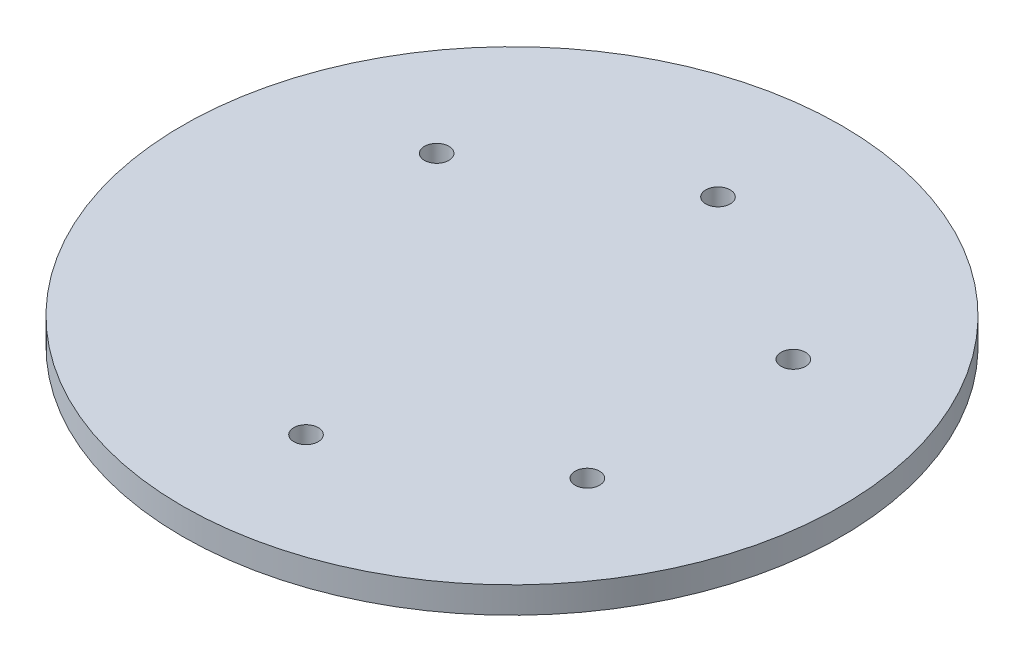
ISO-10303-21;
HEADER;
FILE_DESCRIPTION(('STEP AP214'),'2;1');
FILE_NAME('part.step','',(''),(''),'','','');
FILE_SCHEMA(('AUTOMOTIVE_DESIGN { 1 0 10303 214 1 1 1 1 }'));
ENDSEC;
DATA;
#1=APPLICATION_CONTEXT('core data for automotive mechanical design processes');
#2=APPLICATION_PROTOCOL_DEFINITION('international standard','automotive_design',2000,#1);
#3=PRODUCT_CONTEXT('',#1,'mechanical');
#4=PRODUCT('Part','Part','',(#3));
#5=PRODUCT_RELATED_PRODUCT_CATEGORY('part','',(#4));
#6=PRODUCT_DEFINITION_FORMATION('','',#4);
#7=PRODUCT_DEFINITION_CONTEXT('part definition',#1,'design');
#8=PRODUCT_DEFINITION('design','',#6,#7);
#9=PRODUCT_DEFINITION_SHAPE('','',#8);
#10=(LENGTH_UNIT() NAMED_UNIT(*) SI_UNIT(.MILLI.,.METRE.));
#11=(NAMED_UNIT(*) PLANE_ANGLE_UNIT() SI_UNIT($,.RADIAN.));
#12=(NAMED_UNIT(*) SI_UNIT($,.STERADIAN.) SOLID_ANGLE_UNIT());
#13=UNCERTAINTY_MEASURE_WITH_UNIT(LENGTH_MEASURE(1.E-05),#10,'distance_accuracy_value','');
#14=(GEOMETRIC_REPRESENTATION_CONTEXT(3) GLOBAL_UNCERTAINTY_ASSIGNED_CONTEXT((#13)) GLOBAL_UNIT_ASSIGNED_CONTEXT((#10,
#11,#12)) REPRESENTATION_CONTEXT('',''));
#15=CARTESIAN_POINT('',(0.,0.,0.));
#16=DIRECTION('',(0.,0.,1.));
#17=DIRECTION('',(1.,0.,0.));
#18=AXIS2_PLACEMENT_3D('',#15,#16,#17);
#19=CARTESIAN_POINT('',(0.,-1.6,0.));
#20=DIRECTION('',(0.,1.,0.));
#21=DIRECTION('',(0.,0.,1.));
#22=AXIS2_PLACEMENT_3D('',#19,#20,#21);
#23=CYLINDRICAL_SURFACE('',#22,20.);
#24=CARTESIAN_POINT('',(0.,-1.6,0.));
#25=DIRECTION('',(0.,1.,0.));
#26=DIRECTION('',(0.,0.,1.));
#27=AXIS2_PLACEMENT_3D('',#24,#25,#26);
#28=CIRCLE('',#27,20.);
#29=CARTESIAN_POINT('',(0.,-1.6,20.));
#30=VERTEX_POINT('',#29);
#31=EDGE_CURVE('E10',#30,#30,#28,.T.);
#32=ORIENTED_EDGE('',*,*,#31,.T.);
#33=EDGE_LOOP('',(#32));
#34=FACE_BOUND('',#33,.T.);
#35=CARTESIAN_POINT('',(0.,0.,0.));
#36=DIRECTION('',(0.,1.,0.));
#37=DIRECTION('',(0.,0.,1.));
#38=AXIS2_PLACEMENT_3D('',#35,#36,#37);
#39=CIRCLE('',#38,20.);
#40=CARTESIAN_POINT('',(0.,0.,20.));
#41=VERTEX_POINT('',#40);
#42=EDGE_CURVE('E40',#41,#41,#39,.T.);
#43=ORIENTED_EDGE('',*,*,#42,.F.);
#44=EDGE_LOOP('',(#43));
#45=FACE_BOUND('',#44,.T.);
#46=ADVANCED_FACE('F37',(#34,#45),#23,.T.);
#47=CARTESIAN_POINT('',(0.,-1.6,0.));
#48=DIRECTION('',(0.,1.,0.));
#49=DIRECTION('',(0.,0.,1.));
#50=AXIS2_PLACEMENT_3D('',#47,#48,#49);
#51=PLANE('',#50);
#52=CARTESIAN_POINT('',(-0.00171005024455017,-1.6,12.4988140862944));
#53=DIRECTION('',(0.,-1.,0.));
#54=DIRECTION('',(0.,0.,-1.));
#55=AXIS2_PLACEMENT_3D('',#52,#53,#54);
#56=CIRCLE('',#55,0.743);
#57=CARTESIAN_POINT('',(-0.00171005024455017,-1.6,11.7558140862944));
#58=VERTEX_POINT('',#57);
#59=EDGE_CURVE('E73',#58,#58,#56,.T.);
#60=ORIENTED_EDGE('',*,*,#59,.F.);
#61=EDGE_LOOP('',(#60));
#62=FACE_BOUND('',#61,.T.);
#63=CARTESIAN_POINT('',(10.8234354907875,-1.6,6.25088799010072));
#64=DIRECTION('',(0.,-1.,0.));
#65=DIRECTION('',(0.,0.,-1.));
#66=AXIS2_PLACEMENT_3D('',#63,#64,#65);
#67=CIRCLE('',#66,0.743);
#68=CARTESIAN_POINT('',(10.8234354907875,-1.6,5.50788799010073));
#69=VERTEX_POINT('',#68);
#70=EDGE_CURVE('E70',#69,#69,#67,.T.);
#71=ORIENTED_EDGE('',*,*,#70,.F.);
#72=EDGE_LOOP('',(#71));
#73=FACE_BOUND('',#72,.T.);
#74=CARTESIAN_POINT('',(10.825145541032,-1.6,-6.24792609619374));
#75=DIRECTION('',(0.,-1.,0.));
#76=DIRECTION('',(0.,0.,-1.));
#77=AXIS2_PLACEMENT_3D('',#74,#75,#76);
#78=CIRCLE('',#77,0.743000000000001);
#79=CARTESIAN_POINT('',(10.825145541032,-1.6,-6.99092609619374));
#80=VERTEX_POINT('',#79);
#81=EDGE_CURVE('E64',#80,#80,#78,.T.);
#82=ORIENTED_EDGE('',*,*,#81,.F.);
#83=EDGE_LOOP('',(#82));
#84=FACE_BOUND('',#83,.T.);
#85=CARTESIAN_POINT('',(0.0017100502444629,-1.6,-12.4988140862944));
#86=DIRECTION('',(0.,-1.,0.));
#87=DIRECTION('',(0.,0.,-1.));
#88=AXIS2_PLACEMENT_3D('',#85,#86,#87);
#89=CIRCLE('',#88,0.743);
#90=CARTESIAN_POINT('',(0.0017100502444629,-1.6,-13.2418140862944));
#91=VERTEX_POINT('',#90);
#92=EDGE_CURVE('E58',#91,#91,#89,.T.);
#93=ORIENTED_EDGE('',*,*,#92,.F.);
#94=EDGE_LOOP('',(#93));
#95=FACE_BOUND('',#94,.T.);
#96=CARTESIAN_POINT('',(-10.8234354907876,-1.6,-6.25088799010065));
#97=DIRECTION('',(0.,-1.,0.));
#98=DIRECTION('',(0.,0.,-1.));
#99=AXIS2_PLACEMENT_3D('',#96,#97,#98);
#100=CIRCLE('',#99,0.743);
#101=CARTESIAN_POINT('',(-10.8234354907876,-1.6,-6.99388799010065));
#102=VERTEX_POINT('',#101);
#103=EDGE_CURVE('E52',#102,#102,#100,.T.);
#104=ORIENTED_EDGE('',*,*,#103,.F.);
#105=EDGE_LOOP('',(#104));
#106=FACE_BOUND('',#105,.T.);
#107=ORIENTED_EDGE('',*,*,#31,.F.);
#108=EDGE_LOOP('',(#107));
#109=FACE_BOUND('',#108,.T.);
#110=ADVANCED_FACE('F89',(#62,#73,#84,#95,#106,#109),#51,.F.);
#111=CARTESIAN_POINT('',(0.,0.,0.));
#112=DIRECTION('',(0.,1.,0.));
#113=DIRECTION('',(0.,0.,1.));
#114=AXIS2_PLACEMENT_3D('',#111,#112,#113);
#115=PLANE('',#114);
#116=CARTESIAN_POINT('',(-0.00171005024455017,0.,12.4988140862944));
#117=DIRECTION('',(0.,-1.,0.));
#118=DIRECTION('',(0.,0.,-1.));
#119=AXIS2_PLACEMENT_3D('',#116,#117,#118);
#120=CIRCLE('',#119,0.743);
#121=CARTESIAN_POINT('',(-0.00171005024455017,0.,11.7558140862944));
#122=VERTEX_POINT('',#121);
#123=EDGE_CURVE('E47',#122,#122,#120,.T.);
#124=ORIENTED_EDGE('',*,*,#123,.T.);
#125=EDGE_LOOP('',(#124));
#126=FACE_BOUND('',#125,.T.);
#127=CARTESIAN_POINT('',(10.8234354907875,0.,6.25088799010072));
#128=DIRECTION('',(0.,-1.,0.));
#129=DIRECTION('',(0.,0.,-1.));
#130=AXIS2_PLACEMENT_3D('',#127,#128,#129);
#131=CIRCLE('',#130,0.743);
#132=CARTESIAN_POINT('',(10.8234354907875,0.,5.50788799010073));
#133=VERTEX_POINT('',#132);
#134=EDGE_CURVE('E67',#133,#133,#131,.T.);
#135=ORIENTED_EDGE('',*,*,#134,.T.);
#136=EDGE_LOOP('',(#135));
#137=FACE_BOUND('',#136,.T.);
#138=CARTESIAN_POINT('',(10.825145541032,0.,-6.24792609619374));
#139=DIRECTION('',(0.,-1.,0.));
#140=DIRECTION('',(0.,0.,-1.));
#141=AXIS2_PLACEMENT_3D('',#138,#139,#140);
#142=CIRCLE('',#141,0.743000000000001);
#143=CARTESIAN_POINT('',(10.825145541032,0.,-6.99092609619374));
#144=VERTEX_POINT('',#143);
#145=EDGE_CURVE('E61',#144,#144,#142,.T.);
#146=ORIENTED_EDGE('',*,*,#145,.T.);
#147=EDGE_LOOP('',(#146));
#148=FACE_BOUND('',#147,.T.);
#149=CARTESIAN_POINT('',(0.0017100502444629,0.,-12.4988140862944));
#150=DIRECTION('',(0.,-1.,0.));
#151=DIRECTION('',(0.,0.,-1.));
#152=AXIS2_PLACEMENT_3D('',#149,#150,#151);
#153=CIRCLE('',#152,0.743);
#154=CARTESIAN_POINT('',(0.0017100502444629,0.,-13.2418140862944));
#155=VERTEX_POINT('',#154);
#156=EDGE_CURVE('E55',#155,#155,#153,.T.);
#157=ORIENTED_EDGE('',*,*,#156,.T.);
#158=EDGE_LOOP('',(#157));
#159=FACE_BOUND('',#158,.T.);
#160=CARTESIAN_POINT('',(-10.8234354907876,0.,-6.25088799010065));
#161=DIRECTION('',(0.,-1.,0.));
#162=DIRECTION('',(0.,0.,-1.));
#163=AXIS2_PLACEMENT_3D('',#160,#161,#162);
#164=CIRCLE('',#163,0.743);
#165=CARTESIAN_POINT('',(-10.8234354907876,0.,-6.99388799010065));
#166=VERTEX_POINT('',#165);
#167=EDGE_CURVE('E49',#166,#166,#164,.T.);
#168=ORIENTED_EDGE('',*,*,#167,.T.);
#169=EDGE_LOOP('',(#168));
#170=FACE_BOUND('',#169,.T.);
#171=ORIENTED_EDGE('',*,*,#42,.T.);
#172=EDGE_LOOP('',(#171));
#173=FACE_BOUND('',#172,.T.);
#174=ADVANCED_FACE('F79',(#126,#137,#148,#159,#170,#173),#115,.T.);
#175=CARTESIAN_POINT('',(-10.8234354907876,0.,-6.25088799010065));
#176=DIRECTION('',(0.,-1.,0.));
#177=DIRECTION('',(0.,0.,-1.));
#178=AXIS2_PLACEMENT_3D('',#175,#176,#177);
#179=CYLINDRICAL_SURFACE('',#178,0.743);
#180=ORIENTED_EDGE('',*,*,#167,.F.);
#181=EDGE_LOOP('',(#180));
#182=FACE_BOUND('',#181,.T.);
#183=ORIENTED_EDGE('',*,*,#103,.T.);
#184=EDGE_LOOP('',(#183));
#185=FACE_BOUND('',#184,.T.);
#186=ADVANCED_FACE('F102',(#182,#185),#179,.F.);
#187=CARTESIAN_POINT('',(0.0017100502444629,0.,-12.4988140862944));
#188=DIRECTION('',(0.,-1.,0.));
#189=DIRECTION('',(0.,0.,-1.));
#190=AXIS2_PLACEMENT_3D('',#187,#188,#189);
#191=CYLINDRICAL_SURFACE('',#190,0.743);
#192=ORIENTED_EDGE('',*,*,#156,.F.);
#193=EDGE_LOOP('',(#192));
#194=FACE_BOUND('',#193,.T.);
#195=ORIENTED_EDGE('',*,*,#92,.T.);
#196=EDGE_LOOP('',(#195));
#197=FACE_BOUND('',#196,.T.);
#198=ADVANCED_FACE('F104',(#194,#197),#191,.F.);
#199=CARTESIAN_POINT('',(10.825145541032,0.,-6.24792609619374));
#200=DIRECTION('',(0.,-1.,0.));
#201=DIRECTION('',(0.,0.,-1.));
#202=AXIS2_PLACEMENT_3D('',#199,#200,#201);
#203=CYLINDRICAL_SURFACE('',#202,0.743000000000001);
#204=ORIENTED_EDGE('',*,*,#145,.F.);
#205=EDGE_LOOP('',(#204));
#206=FACE_BOUND('',#205,.T.);
#207=ORIENTED_EDGE('',*,*,#81,.T.);
#208=EDGE_LOOP('',(#207));
#209=FACE_BOUND('',#208,.T.);
#210=ADVANCED_FACE('F111',(#206,#209),#203,.F.);
#211=CARTESIAN_POINT('',(10.8234354907875,0.,6.25088799010072));
#212=DIRECTION('',(0.,-1.,0.));
#213=DIRECTION('',(0.,0.,-1.));
#214=AXIS2_PLACEMENT_3D('',#211,#212,#213);
#215=CYLINDRICAL_SURFACE('',#214,0.743);
#216=ORIENTED_EDGE('',*,*,#134,.F.);
#217=EDGE_LOOP('',(#216));
#218=FACE_BOUND('',#217,.T.);
#219=ORIENTED_EDGE('',*,*,#70,.T.);
#220=EDGE_LOOP('',(#219));
#221=FACE_BOUND('',#220,.T.);
#222=ADVANCED_FACE('F85',(#218,#221),#215,.F.);
#223=CARTESIAN_POINT('',(-0.00171005024455017,0.,12.4988140862944));
#224=DIRECTION('',(0.,-1.,0.));
#225=DIRECTION('',(0.,0.,-1.));
#226=AXIS2_PLACEMENT_3D('',#223,#224,#225);
#227=CYLINDRICAL_SURFACE('',#226,0.743);
#228=ORIENTED_EDGE('',*,*,#123,.F.);
#229=EDGE_LOOP('',(#228));
#230=FACE_BOUND('',#229,.T.);
#231=ORIENTED_EDGE('',*,*,#59,.T.);
#232=EDGE_LOOP('',(#231));
#233=FACE_BOUND('',#232,.T.);
#234=ADVANCED_FACE('F82',(#230,#233),#227,.F.);
#235=CLOSED_SHELL('',(#46,#110,#174,#186,#198,#210,#222,#234));
#236=MANIFOLD_SOLID_BREP('B2',#235);
#237=ADVANCED_BREP_SHAPE_REPRESENTATION('',(#18,#236),#14);
#238=SHAPE_DEFINITION_REPRESENTATION(#9,#237);
ENDSEC;
END-ISO-10303-21;
